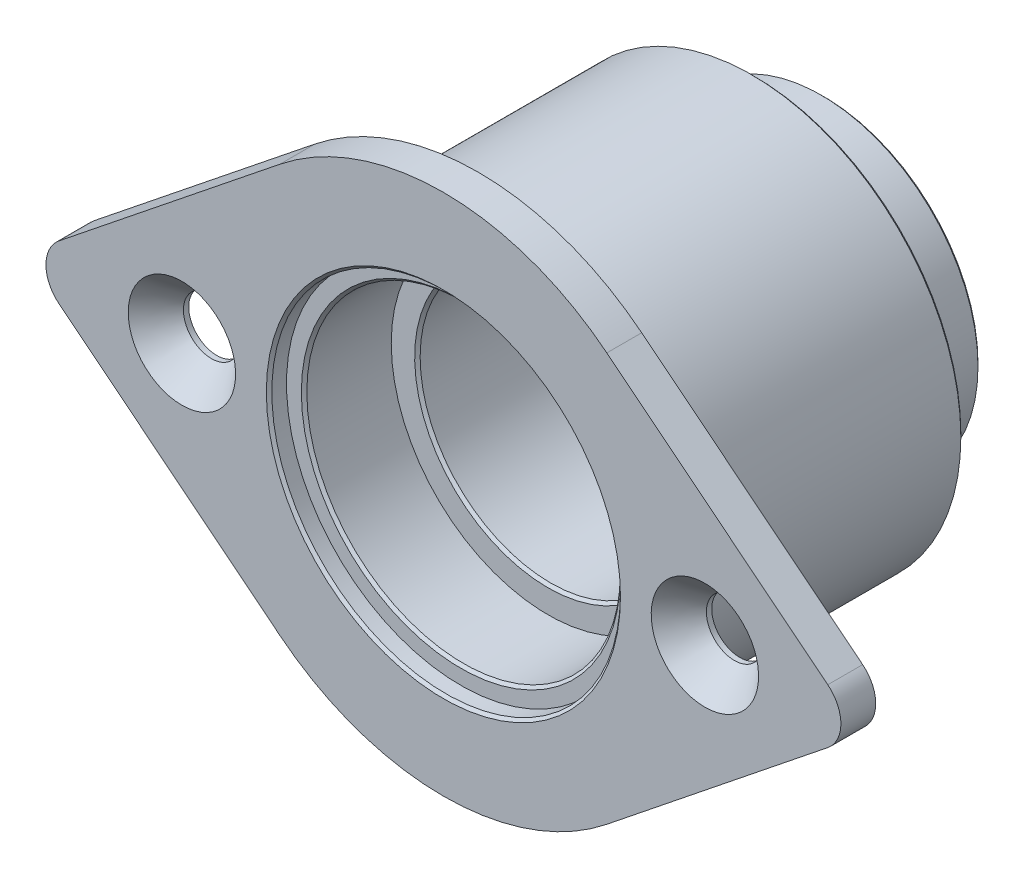
ISO-10303-21;
HEADER;
FILE_DESCRIPTION(('STEP AP214'),'2;1');
FILE_NAME('part.step','',(''),(''),'','','');
FILE_SCHEMA(('AUTOMOTIVE_DESIGN { 1 0 10303 214 1 1 1 1 }'));
ENDSEC;
DATA;
#1=APPLICATION_CONTEXT('core data for automotive mechanical design processes');
#2=APPLICATION_PROTOCOL_DEFINITION('international standard','automotive_design',2000,#1);
#3=PRODUCT_CONTEXT('',#1,'mechanical');
#4=PRODUCT('Part','Part','',(#3));
#5=PRODUCT_RELATED_PRODUCT_CATEGORY('part','',(#4));
#6=PRODUCT_DEFINITION_FORMATION('','',#4);
#7=PRODUCT_DEFINITION_CONTEXT('part definition',#1,'design');
#8=PRODUCT_DEFINITION('design','',#6,#7);
#9=PRODUCT_DEFINITION_SHAPE('','',#8);
#10=(LENGTH_UNIT() NAMED_UNIT(*) SI_UNIT(.MILLI.,.METRE.));
#11=(NAMED_UNIT(*) PLANE_ANGLE_UNIT() SI_UNIT($,.RADIAN.));
#12=(NAMED_UNIT(*) SI_UNIT($,.STERADIAN.) SOLID_ANGLE_UNIT());
#13=UNCERTAINTY_MEASURE_WITH_UNIT(LENGTH_MEASURE(1.E-05),#10,'distance_accuracy_value','');
#14=(GEOMETRIC_REPRESENTATION_CONTEXT(3) GLOBAL_UNCERTAINTY_ASSIGNED_CONTEXT((#13)) GLOBAL_UNIT_ASSIGNED_CONTEXT((#10,
#11,#12)) REPRESENTATION_CONTEXT('',''));
#15=CARTESIAN_POINT('',(0.,0.,0.));
#16=DIRECTION('',(0.,0.,1.));
#17=DIRECTION('',(1.,0.,0.));
#18=AXIS2_PLACEMENT_3D('',#15,#16,#17);
#19=CARTESIAN_POINT('',(0.,0.,-7.9375));
#20=DIRECTION('',(0.,0.,1.));
#21=DIRECTION('',(1.,0.,0.));
#22=AXIS2_PLACEMENT_3D('',#19,#20,#21);
#23=PLANE('',#22);
#24=CARTESIAN_POINT('',(0.,0.,-7.9375));
#25=DIRECTION('',(0.,0.,-1.));
#26=DIRECTION('',(-1.,0.,0.));
#27=AXIS2_PLACEMENT_3D('',#24,#25,#26);
#28=CIRCLE('',#27,14.2748);
#29=CARTESIAN_POINT('',(-14.2748,0.,-7.9375));
#30=VERTEX_POINT('',#29);
#31=EDGE_CURVE('E135',#30,#30,#28,.F.);
#32=ORIENTED_EDGE('',*,*,#31,.T.);
#33=EDGE_LOOP('',(#32));
#34=FACE_BOUND('',#33,.T.);
#35=CARTESIAN_POINT('',(0.,0.,-7.9375));
#36=DIRECTION('',(0.,0.,1.));
#37=DIRECTION('',(0.,-1.,0.));
#38=AXIS2_PLACEMENT_3D('',#35,#36,#37);
#39=CIRCLE('',#38,12.1435499999999);
#40=CARTESIAN_POINT('',(0.,-12.1435499999999,-7.9375));
#41=VERTEX_POINT('',#40);
#42=EDGE_CURVE('E19',#41,#41,#39,.F.);
#43=ORIENTED_EDGE('',*,*,#42,.T.);
#44=EDGE_LOOP('',(#43));
#45=FACE_BOUND('',#44,.T.);
#46=ADVANCED_FACE('F16',(#34,#45),#23,.T.);
#47=CARTESIAN_POINT('',(0.,0.,-7.9375));
#48=DIRECTION('',(0.,0.,1.));
#49=DIRECTION('',(0.,-1.,0.));
#50=AXIS2_PLACEMENT_3D('',#47,#48,#49);
#51=CONICAL_SURFACE('',#50,12.1435499999999,0.785398163397434);
#52=CARTESIAN_POINT('',(0.,0.,-8.18749999999995));
#53=DIRECTION('',(0.,0.,-1.));
#54=DIRECTION('',(-1.,0.,0.));
#55=AXIS2_PLACEMENT_3D('',#52,#53,#54);
#56=CIRCLE('',#55,11.89355);
#57=CARTESIAN_POINT('',(-11.89355,0.,-8.18749999999995));
#58=VERTEX_POINT('',#57);
#59=EDGE_CURVE('E133',#58,#58,#56,.T.);
#60=ORIENTED_EDGE('',*,*,#59,.T.);
#61=EDGE_LOOP('',(#60));
#62=FACE_BOUND('',#61,.T.);
#63=ORIENTED_EDGE('',*,*,#42,.F.);
#64=EDGE_LOOP('',(#63));
#65=FACE_BOUND('',#64,.T.);
#66=ADVANCED_FACE('F194',(#62,#65),#51,.F.);
#67=CARTESIAN_POINT('',(0.,0.,1.5875));
#68=DIRECTION('',(0.,0.,-1.));
#69=DIRECTION('',(-1.,0.,0.));
#70=AXIS2_PLACEMENT_3D('',#67,#68,#69);
#71=CYLINDRICAL_SURFACE('',#70,14.2748);
#72=CARTESIAN_POINT('',(0.,0.,-0.249999999999985));
#73=DIRECTION('',(0.,0.,1.));
#74=DIRECTION('',(1.,0.,0.));
#75=AXIS2_PLACEMENT_3D('',#72,#73,#74);
#76=CIRCLE('',#75,14.2748);
#77=CARTESIAN_POINT('',(14.2748,0.,-0.249999999999985));
#78=VERTEX_POINT('',#77);
#79=EDGE_CURVE('E130',#78,#78,#76,.T.);
#80=ORIENTED_EDGE('',*,*,#79,.T.);
#81=EDGE_LOOP('',(#80));
#82=FACE_BOUND('',#81,.T.);
#83=ORIENTED_EDGE('',*,*,#31,.F.);
#84=EDGE_LOOP('',(#83));
#85=FACE_BOUND('',#84,.T.);
#86=ADVANCED_FACE('F196',(#82,#85),#71,.F.);
#87=CARTESIAN_POINT('',(0.,0.,38.7877315203269));
#88=DIRECTION('',(0.,0.,-1.));
#89=DIRECTION('',(-1.,0.,0.));
#90=AXIS2_PLACEMENT_3D('',#87,#88,#89);
#91=CYLINDRICAL_SURFACE('',#90,11.89355);
#92=ORIENTED_EDGE('',*,*,#59,.F.);
#93=EDGE_LOOP('',(#92));
#94=FACE_BOUND('',#93,.T.);
#95=CARTESIAN_POINT('',(0.,0.,-32.8334999999999));
#96=DIRECTION('',(0.,0.,-1.));
#97=DIRECTION('',(-1.,0.,0.));
#98=AXIS2_PLACEMENT_3D('',#95,#96,#97);
#99=CIRCLE('',#98,11.89355);
#100=CARTESIAN_POINT('',(-11.89355,0.,-32.8334999999999));
#101=VERTEX_POINT('',#100);
#102=EDGE_CURVE('E126',#101,#101,#99,.T.);
#103=ORIENTED_EDGE('',*,*,#102,.T.);
#104=EDGE_LOOP('',(#103));
#105=FACE_BOUND('',#104,.T.);
#106=ADVANCED_FACE('F203',(#94,#105),#91,.F.);
#107=CARTESIAN_POINT('',(0.,0.,0.));
#108=DIRECTION('',(0.,0.,1.));
#109=DIRECTION('',(1.,0.,0.));
#110=AXIS2_PLACEMENT_3D('',#107,#108,#109);
#111=CONICAL_SURFACE('',#110,14.5248,0.785398163397459);
#112=ORIENTED_EDGE('',*,*,#79,.F.);
#113=EDGE_LOOP('',(#112));
#114=FACE_BOUND('',#113,.T.);
#115=CARTESIAN_POINT('',(0.,0.,0.));
#116=DIRECTION('',(0.,0.,1.));
#117=DIRECTION('',(1.,0.,0.));
#118=AXIS2_PLACEMENT_3D('',#115,#116,#117);
#119=CIRCLE('',#118,14.5248);
#120=CARTESIAN_POINT('',(14.5248,0.,0.));
#121=VERTEX_POINT('',#120);
#122=EDGE_CURVE('E129',#121,#121,#119,.F.);
#123=ORIENTED_EDGE('',*,*,#122,.F.);
#124=EDGE_LOOP('',(#123));
#125=FACE_BOUND('',#124,.T.);
#126=ADVANCED_FACE('F300',(#114,#125),#111,.F.);
#127=CARTESIAN_POINT('',(0.,0.,-33.0835));
#128=DIRECTION('',(0.,0.,-1.));
#129=DIRECTION('',(0.,1.,0.));
#130=AXIS2_PLACEMENT_3D('',#127,#128,#129);
#131=CONICAL_SURFACE('',#130,12.1435500000001,0.785398163397448);
#132=ORIENTED_EDGE('',*,*,#102,.F.);
#133=EDGE_LOOP('',(#132));
#134=FACE_BOUND('',#133,.T.);
#135=CARTESIAN_POINT('',(0.,0.,-33.0835));
#136=DIRECTION('',(0.,0.,-1.));
#137=DIRECTION('',(0.,1.,0.));
#138=AXIS2_PLACEMENT_3D('',#135,#136,#137);
#139=CIRCLE('',#138,12.1435500000001);
#140=CARTESIAN_POINT('',(0.,12.1435500000001,-33.0835));
#141=VERTEX_POINT('',#140);
#142=EDGE_CURVE('E183',#141,#141,#139,.F.);
#143=ORIENTED_EDGE('',*,*,#142,.F.);
#144=EDGE_LOOP('',(#143));
#145=FACE_BOUND('',#144,.T.);
#146=ADVANCED_FACE('F296',(#134,#145),#131,.F.);
#147=CARTESIAN_POINT('',(0.,0.,0.));
#148=DIRECTION('',(0.,0.,1.));
#149=DIRECTION('',(1.,0.,0.));
#150=AXIS2_PLACEMENT_3D('',#147,#148,#149);
#151=PLANE('',#150);
#152=CARTESIAN_POINT('',(0.,0.,0.));
#153=DIRECTION('',(0.,0.,1.));
#154=DIRECTION('',(1.,0.,0.));
#155=AXIS2_PLACEMENT_3D('',#152,#153,#154);
#156=CIRCLE('',#155,15.875);
#157=CARTESIAN_POINT('',(15.875,0.,0.));
#158=VERTEX_POINT('',#157);
#159=EDGE_CURVE('E180',#158,#158,#156,.T.);
#160=ORIENTED_EDGE('',*,*,#159,.T.);
#161=EDGE_LOOP('',(#160));
#162=FACE_BOUND('',#161,.T.);
#163=ORIENTED_EDGE('',*,*,#122,.T.);
#164=EDGE_LOOP('',(#163));
#165=FACE_BOUND('',#164,.T.);
#166=ADVANCED_FACE('F292',(#162,#165),#151,.T.);
#167=CARTESIAN_POINT('',(0.,0.,-33.0835));
#168=DIRECTION('',(0.,0.,-1.));
#169=DIRECTION('',(-1.,0.,0.));
#170=AXIS2_PLACEMENT_3D('',#167,#168,#169);
#171=PLANE('',#170);
#172=ORIENTED_EDGE('',*,*,#142,.T.);
#173=EDGE_LOOP('',(#172));
#174=FACE_BOUND('',#173,.T.);
#175=CARTESIAN_POINT('',(0.,0.,-33.0835));
#176=DIRECTION('',(0.,0.,1.));
#177=DIRECTION('',(1.,0.,0.));
#178=AXIS2_PLACEMENT_3D('',#175,#176,#177);
#179=CIRCLE('',#178,14.0121);
#180=CARTESIAN_POINT('',(14.0121,0.,-33.0835));
#181=VERTEX_POINT('',#180);
#182=EDGE_CURVE('E125',#181,#181,#179,.T.);
#183=ORIENTED_EDGE('',*,*,#182,.F.);
#184=EDGE_LOOP('',(#183));
#185=FACE_BOUND('',#184,.T.);
#186=ADVANCED_FACE('F288',(#174,#185),#171,.T.);
#187=CARTESIAN_POINT('',(0.,0.,0.));
#188=DIRECTION('',(0.,0.,1.));
#189=DIRECTION('',(1.,0.,0.));
#190=AXIS2_PLACEMENT_3D('',#187,#188,#189);
#191=CYLINDRICAL_SURFACE('',#190,15.875);
#192=ORIENTED_EDGE('',*,*,#159,.F.);
#193=EDGE_LOOP('',(#192));
#194=FACE_BOUND('',#193,.T.);
#195=CARTESIAN_POINT('',(0.,0.,1.3375));
#196=DIRECTION('',(0.,0.,1.));
#197=DIRECTION('',(1.,0.,0.));
#198=AXIS2_PLACEMENT_3D('',#195,#196,#197);
#199=CIRCLE('',#198,15.875);
#200=CARTESIAN_POINT('',(15.875,0.,1.3375));
#201=VERTEX_POINT('',#200);
#202=EDGE_CURVE('E122',#201,#201,#199,.T.);
#203=ORIENTED_EDGE('',*,*,#202,.T.);
#204=EDGE_LOOP('',(#203));
#205=FACE_BOUND('',#204,.T.);
#206=ADVANCED_FACE('F284',(#194,#205),#191,.F.);
#207=CARTESIAN_POINT('',(0.,0.,-32.8335));
#208=DIRECTION('',(0.,0.,1.));
#209=DIRECTION('',(1.,0.,0.));
#210=AXIS2_PLACEMENT_3D('',#207,#208,#209);
#211=CONICAL_SURFACE('',#210,14.2621,0.785398163397424);
#212=CARTESIAN_POINT('',(0.,0.,-32.8335));
#213=DIRECTION('',(0.,0.,-1.));
#214=DIRECTION('',(-1.,0.,0.));
#215=AXIS2_PLACEMENT_3D('',#212,#213,#214);
#216=CIRCLE('',#215,14.2621);
#217=CARTESIAN_POINT('',(-14.2621,0.,-32.8335));
#218=VERTEX_POINT('',#217);
#219=EDGE_CURVE('E118',#218,#218,#216,.F.);
#220=ORIENTED_EDGE('',*,*,#219,.F.);
#221=EDGE_LOOP('',(#220));
#222=FACE_BOUND('',#221,.T.);
#223=ORIENTED_EDGE('',*,*,#182,.T.);
#224=EDGE_LOOP('',(#223));
#225=FACE_BOUND('',#224,.T.);
#226=ADVANCED_FACE('F280',(#222,#225),#211,.T.);
#227=CARTESIAN_POINT('',(0.,0.,1.5875));
#228=DIRECTION('',(0.,0.,1.));
#229=DIRECTION('',(1.,0.,0.));
#230=AXIS2_PLACEMENT_3D('',#227,#228,#229);
#231=CONICAL_SURFACE('',#230,16.125,0.785398163397476);
#232=ORIENTED_EDGE('',*,*,#202,.F.);
#233=EDGE_LOOP('',(#232));
#234=FACE_BOUND('',#233,.T.);
#235=CARTESIAN_POINT('',(0.,0.,1.5875));
#236=DIRECTION('',(0.,0.,1.));
#237=DIRECTION('',(1.,0.,0.));
#238=AXIS2_PLACEMENT_3D('',#235,#236,#237);
#239=CIRCLE('',#238,16.125);
#240=CARTESIAN_POINT('',(16.125,0.,1.5875));
#241=VERTEX_POINT('',#240);
#242=EDGE_CURVE('E121',#241,#241,#239,.F.);
#243=ORIENTED_EDGE('',*,*,#242,.F.);
#244=EDGE_LOOP('',(#243));
#245=FACE_BOUND('',#244,.T.);
#246=ADVANCED_FACE('F276',(#234,#245),#231,.F.);
#247=CARTESIAN_POINT('',(0.,0.,27.1480367264149));
#248=DIRECTION('',(0.,0.,-1.));
#249=DIRECTION('',(-1.,0.,0.));
#250=AXIS2_PLACEMENT_3D('',#247,#248,#249);
#251=CYLINDRICAL_SURFACE('',#250,14.2621);
#252=ORIENTED_EDGE('',*,*,#219,.T.);
#253=EDGE_LOOP('',(#252));
#254=FACE_BOUND('',#253,.T.);
#255=CARTESIAN_POINT('',(0.,0.,-26.7335));
#256=DIRECTION('',(0.,0.,-1.));
#257=DIRECTION('',(-1.,0.,0.));
#258=AXIS2_PLACEMENT_3D('',#255,#256,#257);
#259=CIRCLE('',#258,14.2621);
#260=CARTESIAN_POINT('',(-14.2621,0.,-26.7335));
#261=VERTEX_POINT('',#260);
#262=EDGE_CURVE('E117',#261,#261,#259,.F.);
#263=ORIENTED_EDGE('',*,*,#262,.F.);
#264=EDGE_LOOP('',(#263));
#265=FACE_BOUND('',#264,.T.);
#266=ADVANCED_FACE('F272',(#254,#265),#251,.T.);
#267=CARTESIAN_POINT('',(-23.8125,0.,1.58749999997099));
#268=DIRECTION('',(0.,0.,1.));
#269=DIRECTION('',(0.,-1.,0.));
#270=AXIS2_PLACEMENT_3D('',#267,#268,#269);
#271=CONICAL_SURFACE('',#270,4.88949999997067,0.71558499333661);
#272=CARTESIAN_POINT('',(-23.8125,0.,-1.10068089399406));
#273=DIRECTION('',(0.,0.,1.));
#274=DIRECTION('',(1.,0.,0.));
#275=AXIS2_PLACEMENT_3D('',#272,#273,#274);
#276=CIRCLE('',#275,2.5527);
#277=CARTESIAN_POINT('',(-21.2598,0.,-1.10068089399406));
#278=VERTEX_POINT('',#277);
#279=EDGE_CURVE('E114',#278,#278,#276,.F.);
#280=ORIENTED_EDGE('',*,*,#279,.T.);
#281=EDGE_LOOP('',(#280));
#282=FACE_BOUND('',#281,.T.);
#283=CARTESIAN_POINT('',(-23.8125,0.,1.58749999997099));
#284=DIRECTION('',(0.,0.,1.));
#285=DIRECTION('',(0.,-1.,0.));
#286=AXIS2_PLACEMENT_3D('',#283,#284,#285);
#287=CIRCLE('',#286,4.88949999997067);
#288=CARTESIAN_POINT('',(-23.8125,-4.88949999997067,1.58749999997099));
#289=VERTEX_POINT('',#288);
#290=EDGE_CURVE('E173',#289,#289,#287,.F.);
#291=ORIENTED_EDGE('',*,*,#290,.F.);
#292=EDGE_LOOP('',(#291));
#293=FACE_BOUND('',#292,.T.);
#294=ADVANCED_FACE('F268',(#282,#293),#271,.F.);
#295=CARTESIAN_POINT('',(23.8125,0.,1.58749999997099));
#296=DIRECTION('',(0.,0.,1.));
#297=DIRECTION('',(0.,-1.,0.));
#298=AXIS2_PLACEMENT_3D('',#295,#296,#297);
#299=CONICAL_SURFACE('',#298,4.88949999995293,0.71558499333661);
#300=CARTESIAN_POINT('',(23.8125,0.,-1.10068089399406));
#301=DIRECTION('',(0.,0.,1.));
#302=DIRECTION('',(1.,0.,0.));
#303=AXIS2_PLACEMENT_3D('',#300,#301,#302);
#304=CIRCLE('',#303,2.5527);
#305=CARTESIAN_POINT('',(26.3652,0.,-1.10068089399406));
#306=VERTEX_POINT('',#305);
#307=EDGE_CURVE('E92',#306,#306,#304,.F.);
#308=ORIENTED_EDGE('',*,*,#307,.T.);
#309=EDGE_LOOP('',(#308));
#310=FACE_BOUND('',#309,.T.);
#311=CARTESIAN_POINT('',(23.8125,0.,1.58749999997099));
#312=DIRECTION('',(0.,0.,1.));
#313=DIRECTION('',(0.,-1.,0.));
#314=AXIS2_PLACEMENT_3D('',#311,#312,#313);
#315=CIRCLE('',#314,4.88949999995293);
#316=CARTESIAN_POINT('',(23.8125,-4.88949999995292,1.58749999997099));
#317=VERTEX_POINT('',#316);
#318=EDGE_CURVE('E170',#317,#317,#315,.F.);
#319=ORIENTED_EDGE('',*,*,#318,.F.);
#320=EDGE_LOOP('',(#319));
#321=FACE_BOUND('',#320,.T.);
#322=ADVANCED_FACE('F265',(#310,#321),#299,.F.);
#323=CARTESIAN_POINT('',(0.,0.,1.5875));
#324=DIRECTION('',(0.,0.,1.));
#325=DIRECTION('',(1.,0.,0.));
#326=AXIS2_PLACEMENT_3D('',#323,#324,#325);
#327=PLANE('',#326);
#328=DIRECTION('',(-0.7806247497998,0.625,0.));
#329=VECTOR('',#328,1.);
#330=CARTESIAN_POINT('',(-14.8828125,-18.5886268546077,1.5875));
#331=LINE('',#330,#329);
#332=CARTESIAN_POINT('',(-35.004375,-2.47848358061436,1.5875));
#333=VERTEX_POINT('',#332);
#334=CARTESIAN_POINT('',(-14.8828125,-18.5886268546077,1.5875));
#335=VERTEX_POINT('',#334);
#336=EDGE_CURVE('E110',#333,#335,#331,.F.);
#337=ORIENTED_EDGE('',*,*,#336,.T.);
#338=CARTESIAN_POINT('',(0.,0.,1.5875));
#339=DIRECTION('',(0.,0.,-1.));
#340=DIRECTION('',(-1.,0.,0.));
#341=AXIS2_PLACEMENT_3D('',#338,#339,#340);
#342=CIRCLE('',#341,23.8125);
#343=CARTESIAN_POINT('',(14.8828125,-18.5886268546077,1.5875));
#344=VERTEX_POINT('',#343);
#345=EDGE_CURVE('E162',#344,#335,#342,.T.);
#346=ORIENTED_EDGE('',*,*,#345,.F.);
#347=DIRECTION('',(0.7806247497998,0.625,0.));
#348=VECTOR('',#347,1.);
#349=CARTESIAN_POINT('',(14.8828125,-18.5886268546077,1.5875));
#350=LINE('',#349,#348);
#351=CARTESIAN_POINT('',(35.004375,-2.47848358061437,1.5875));
#352=VERTEX_POINT('',#351);
#353=EDGE_CURVE('E526',#352,#344,#350,.F.);
#354=ORIENTED_EDGE('',*,*,#353,.F.);
#355=CARTESIAN_POINT('',(33.02,0.,1.5875));
#356=DIRECTION('',(0.,0.,-1.));
#357=DIRECTION('',(-1.,0.,0.));
#358=AXIS2_PLACEMENT_3D('',#355,#356,#357);
#359=CIRCLE('',#358,3.175);
#360=CARTESIAN_POINT('',(35.004375,2.47848358061436,1.5875));
#361=VERTEX_POINT('',#360);
#362=EDGE_CURVE('E157',#361,#352,#359,.T.);
#363=ORIENTED_EDGE('',*,*,#362,.F.);
#364=DIRECTION('',(-0.7806247497998,0.625,0.));
#365=VECTOR('',#364,1.);
#366=CARTESIAN_POINT('',(14.8828125,18.5886268546077,1.5875));
#367=LINE('',#366,#365);
#368=CARTESIAN_POINT('',(14.8828125,18.5886268546077,1.5875));
#369=VERTEX_POINT('',#368);
#370=EDGE_CURVE('E88',#369,#361,#367,.F.);
#371=ORIENTED_EDGE('',*,*,#370,.F.);
#372=CARTESIAN_POINT('',(0.,0.,1.5875));
#373=DIRECTION('',(0.,0.,-1.));
#374=DIRECTION('',(-1.,0.,0.));
#375=AXIS2_PLACEMENT_3D('',#372,#373,#374);
#376=CIRCLE('',#375,23.8125);
#377=CARTESIAN_POINT('',(-14.8828125,18.5886268546077,1.5875));
#378=VERTEX_POINT('',#377);
#379=EDGE_CURVE('E80',#378,#369,#376,.T.);
#380=ORIENTED_EDGE('',*,*,#379,.F.);
#381=DIRECTION('',(0.7806247497998,0.625,0.));
#382=VECTOR('',#381,1.);
#383=CARTESIAN_POINT('',(-14.8828125,18.5886268546077,1.5875));
#384=LINE('',#383,#382);
#385=CARTESIAN_POINT('',(-35.004375,2.47848358061436,1.5875));
#386=VERTEX_POINT('',#385);
#387=EDGE_CURVE('E85',#378,#386,#384,.F.);
#388=ORIENTED_EDGE('',*,*,#387,.T.);
#389=CARTESIAN_POINT('',(-33.02,0.,1.5875));
#390=DIRECTION('',(0.,0.,-1.));
#391=DIRECTION('',(-1.,0.,0.));
#392=AXIS2_PLACEMENT_3D('',#389,#390,#391);
#393=CIRCLE('',#392,3.175);
#394=EDGE_CURVE('E106',#333,#386,#393,.T.);
#395=ORIENTED_EDGE('',*,*,#394,.F.);
#396=EDGE_LOOP('',(#337,#346,#354,#363,#371,#380,#388,#395));
#397=FACE_BOUND('',#396,.T.);
#398=ORIENTED_EDGE('',*,*,#318,.T.);
#399=EDGE_LOOP('',(#398));
#400=FACE_BOUND('',#399,.T.);
#401=ORIENTED_EDGE('',*,*,#290,.T.);
#402=EDGE_LOOP('',(#401));
#403=FACE_BOUND('',#402,.T.);
#404=ORIENTED_EDGE('',*,*,#242,.T.);
#405=EDGE_LOOP('',(#404));
#406=FACE_BOUND('',#405,.T.);
#407=ADVANCED_FACE('F82',(#397,#400,#403,#406),#327,.T.);
#408=CARTESIAN_POINT('',(0.,0.,-26.7335));
#409=DIRECTION('',(0.,0.,-1.));
#410=DIRECTION('',(-1.,0.,0.));
#411=AXIS2_PLACEMENT_3D('',#408,#409,#410);
#412=PLANE('',#411);
#413=ORIENTED_EDGE('',*,*,#262,.T.);
#414=EDGE_LOOP('',(#413));
#415=FACE_BOUND('',#414,.T.);
#416=CARTESIAN_POINT('',(0.,0.,-26.7335));
#417=DIRECTION('',(0.,0.,1.));
#418=DIRECTION('',(1.,0.,0.));
#419=AXIS2_PLACEMENT_3D('',#416,#417,#418);
#420=CIRCLE('',#419,18.8);
#421=CARTESIAN_POINT('',(18.8,0.,-26.7335));
#422=VERTEX_POINT('',#421);
#423=EDGE_CURVE('E153',#422,#422,#420,.T.);
#424=ORIENTED_EDGE('',*,*,#423,.F.);
#425=EDGE_LOOP('',(#424));
#426=FACE_BOUND('',#425,.T.);
#427=ADVANCED_FACE('F258',(#415,#426),#412,.T.);
#428=CARTESIAN_POINT('',(-23.8125,0.,1.5875));
#429=DIRECTION('',(0.,0.,1.));
#430=DIRECTION('',(1.,0.,0.));
#431=AXIS2_PLACEMENT_3D('',#428,#429,#430);
#432=CYLINDRICAL_SURFACE('',#431,2.5527);
#433=CARTESIAN_POINT('',(-23.8125,0.,-1.5875));
#434=DIRECTION('',(0.,0.,1.));
#435=DIRECTION('',(1.,0.,0.));
#436=AXIS2_PLACEMENT_3D('',#433,#434,#435);
#437=CIRCLE('',#436,2.5527);
#438=CARTESIAN_POINT('',(-21.2598,0.,-1.5875));
#439=VERTEX_POINT('',#438);
#440=EDGE_CURVE('E150',#439,#439,#437,.F.);
#441=ORIENTED_EDGE('',*,*,#440,.T.);
#442=EDGE_LOOP('',(#441));
#443=FACE_BOUND('',#442,.T.);
#444=ORIENTED_EDGE('',*,*,#279,.F.);
#445=EDGE_LOOP('',(#444));
#446=FACE_BOUND('',#445,.T.);
#447=ADVANCED_FACE('F254',(#443,#446),#432,.F.);
#448=CARTESIAN_POINT('',(23.8125,0.,1.5875));
#449=DIRECTION('',(0.,0.,1.));
#450=DIRECTION('',(1.,0.,0.));
#451=AXIS2_PLACEMENT_3D('',#448,#449,#450);
#452=CYLINDRICAL_SURFACE('',#451,2.5527);
#453=CARTESIAN_POINT('',(23.8125,0.,-1.5875));
#454=DIRECTION('',(0.,0.,1.));
#455=DIRECTION('',(1.,0.,0.));
#456=AXIS2_PLACEMENT_3D('',#453,#454,#455);
#457=CIRCLE('',#456,2.5527);
#458=CARTESIAN_POINT('',(26.3652,0.,-1.5875));
#459=VERTEX_POINT('',#458);
#460=EDGE_CURVE('E147',#459,#459,#457,.F.);
#461=ORIENTED_EDGE('',*,*,#460,.T.);
#462=EDGE_LOOP('',(#461));
#463=FACE_BOUND('',#462,.T.);
#464=ORIENTED_EDGE('',*,*,#307,.F.);
#465=EDGE_LOOP('',(#464));
#466=FACE_BOUND('',#465,.T.);
#467=ADVANCED_FACE('F251',(#463,#466),#452,.F.);
#468=CARTESIAN_POINT('',(0.,0.,1.5875));
#469=DIRECTION('',(0.,0.,-1.));
#470=DIRECTION('',(-1.,0.,0.));
#471=AXIS2_PLACEMENT_3D('',#468,#469,#470);
#472=CYLINDRICAL_SURFACE('',#471,23.8125);
#473=ORIENTED_EDGE('',*,*,#379,.T.);
#474=DIRECTION('',(0.,0.,1.));
#475=VECTOR('',#474,1.);
#476=CARTESIAN_POINT('',(14.8828125,18.5886268546077,1.5875));
#477=LINE('',#476,#475);
#478=CARTESIAN_POINT('',(14.8828125,18.5886268546077,-1.5875));
#479=VERTEX_POINT('',#478);
#480=EDGE_CURVE('E156',#479,#369,#477,.T.);
#481=ORIENTED_EDGE('',*,*,#480,.F.);
#482=CARTESIAN_POINT('',(0.,0.,-1.5875));
#483=DIRECTION('',(0.,0.,-1.));
#484=DIRECTION('',(-1.,0.,0.));
#485=AXIS2_PLACEMENT_3D('',#482,#483,#484);
#486=CIRCLE('',#485,23.8125);
#487=CARTESIAN_POINT('',(-14.8828125,18.5886268546077,-1.5875));
#488=VERTEX_POINT('',#487);
#489=EDGE_CURVE('E97',#479,#488,#486,.F.);
#490=ORIENTED_EDGE('',*,*,#489,.T.);
#491=DIRECTION('',(0.,0.,1.));
#492=VECTOR('',#491,1.);
#493=CARTESIAN_POINT('',(-14.8828125,18.5886268546077,1.5875));
#494=LINE('',#493,#492);
#495=EDGE_CURVE('E91',#488,#378,#494,.T.);
#496=ORIENTED_EDGE('',*,*,#495,.T.);
#497=EDGE_LOOP('',(#473,#481,#490,#496));
#498=FACE_BOUND('',#497,.T.);
#499=ADVANCED_FACE('F95',(#498),#472,.T.);
#500=CARTESIAN_POINT('',(-14.8828125,18.5886268546077,1.5875));
#501=DIRECTION('',(0.625,-0.7806247497998,0.));
#502=DIRECTION('',(0.7806247497998,0.625,0.));
#503=AXIS2_PLACEMENT_3D('',#500,#501,#502);
#504=PLANE('',#503);
#505=DIRECTION('',(0.,0.,-1.));
#506=VECTOR('',#505,1.);
#507=CARTESIAN_POINT('',(-35.004375,2.47848358061435,1.5875));
#508=LINE('',#507,#506);
#509=CARTESIAN_POINT('',(-35.004375,2.47848358061436,-1.5875));
#510=VERTEX_POINT('',#509);
#511=EDGE_CURVE('E104',#386,#510,#508,.T.);
#512=ORIENTED_EDGE('',*,*,#511,.F.);
#513=ORIENTED_EDGE('',*,*,#387,.F.);
#514=ORIENTED_EDGE('',*,*,#495,.F.);
#515=DIRECTION('',(-0.7806247497998,-0.625,0.));
#516=VECTOR('',#515,1.);
#517=CARTESIAN_POINT('',(-14.8828125,18.5886268546077,-1.5875));
#518=LINE('',#517,#516);
#519=EDGE_CURVE('E145',#488,#510,#518,.T.);
#520=ORIENTED_EDGE('',*,*,#519,.T.);
#521=EDGE_LOOP('',(#512,#513,#514,#520));
#522=FACE_BOUND('',#521,.T.);
#523=ADVANCED_FACE('F102',(#522),#504,.F.);
#524=CARTESIAN_POINT('',(-33.02,0.,1.5875));
#525=DIRECTION('',(0.,0.,-1.));
#526=DIRECTION('',(-1.,0.,0.));
#527=AXIS2_PLACEMENT_3D('',#524,#525,#526);
#528=CYLINDRICAL_SURFACE('',#527,3.175);
#529=CARTESIAN_POINT('',(-33.02,0.,-1.5875));
#530=DIRECTION('',(0.,0.,-1.));
#531=DIRECTION('',(-1.,0.,0.));
#532=AXIS2_PLACEMENT_3D('',#529,#530,#531);
#533=CIRCLE('',#532,3.175);
#534=CARTESIAN_POINT('',(-35.004375,-2.47848358061437,-1.5875));
#535=VERTEX_POINT('',#534);
#536=EDGE_CURVE('E143',#510,#535,#533,.F.);
#537=ORIENTED_EDGE('',*,*,#536,.T.);
#538=DIRECTION('',(0.,0.,1.));
#539=VECTOR('',#538,1.);
#540=CARTESIAN_POINT('',(-35.004375,-2.47848358061437,1.5875));
#541=LINE('',#540,#539);
#542=EDGE_CURVE('E166',#535,#333,#541,.T.);
#543=ORIENTED_EDGE('',*,*,#542,.T.);
#544=ORIENTED_EDGE('',*,*,#394,.T.);
#545=ORIENTED_EDGE('',*,*,#511,.T.);
#546=EDGE_LOOP('',(#537,#543,#544,#545));
#547=FACE_BOUND('',#546,.T.);
#548=ADVANCED_FACE('F242',(#547),#528,.T.);
#549=CARTESIAN_POINT('',(-14.8828125,-18.5886268546077,1.5875));
#550=DIRECTION('',(0.625,0.7806247497998,0.));
#551=DIRECTION('',(-0.7806247497998,0.625,0.));
#552=AXIS2_PLACEMENT_3D('',#549,#550,#551);
#553=PLANE('',#552);
#554=ORIENTED_EDGE('',*,*,#542,.F.);
#555=DIRECTION('',(0.7806247497998,-0.625,0.));
#556=VECTOR('',#555,1.);
#557=CARTESIAN_POINT('',(-35.004375,-2.47848358061437,-1.5875));
#558=LINE('',#557,#556);
#559=CARTESIAN_POINT('',(-14.8828125,-18.5886268546077,-1.5875));
#560=VERTEX_POINT('',#559);
#561=EDGE_CURVE('E142',#535,#560,#558,.T.);
#562=ORIENTED_EDGE('',*,*,#561,.T.);
#563=DIRECTION('',(0.,0.,-1.));
#564=VECTOR('',#563,1.);
#565=CARTESIAN_POINT('',(-14.8828125,-18.5886268546077,1.5875));
#566=LINE('',#565,#564);
#567=EDGE_CURVE('E165',#335,#560,#566,.T.);
#568=ORIENTED_EDGE('',*,*,#567,.F.);
#569=ORIENTED_EDGE('',*,*,#336,.F.);
#570=EDGE_LOOP('',(#554,#562,#568,#569));
#571=FACE_BOUND('',#570,.T.);
#572=ADVANCED_FACE('F238',(#571),#553,.F.);
#573=CARTESIAN_POINT('',(0.,0.,1.5875));
#574=DIRECTION('',(0.,0.,-1.));
#575=DIRECTION('',(-1.,0.,0.));
#576=AXIS2_PLACEMENT_3D('',#573,#574,#575);
#577=CYLINDRICAL_SURFACE('',#576,23.8125);
#578=ORIENTED_EDGE('',*,*,#345,.T.);
#579=ORIENTED_EDGE('',*,*,#567,.T.);
#580=CARTESIAN_POINT('',(0.,0.,-1.5875));
#581=DIRECTION('',(0.,0.,-1.));
#582=DIRECTION('',(-1.,0.,0.));
#583=AXIS2_PLACEMENT_3D('',#580,#581,#582);
#584=CIRCLE('',#583,23.8125);
#585=CARTESIAN_POINT('',(14.8828125,-18.5886268546077,-1.5875));
#586=VERTEX_POINT('',#585);
#587=EDGE_CURVE('E140',#560,#586,#584,.F.);
#588=ORIENTED_EDGE('',*,*,#587,.T.);
#589=DIRECTION('',(0.,0.,1.));
#590=VECTOR('',#589,1.);
#591=CARTESIAN_POINT('',(14.8828125,-18.5886268546077,1.5875));
#592=LINE('',#591,#590);
#593=EDGE_CURVE('E161',#344,#586,#592,.F.);
#594=ORIENTED_EDGE('',*,*,#593,.F.);
#595=EDGE_LOOP('',(#578,#579,#588,#594));
#596=FACE_BOUND('',#595,.T.);
#597=ADVANCED_FACE('F234',(#596),#577,.T.);
#598=CARTESIAN_POINT('',(14.8828125,-18.5886268546077,1.5875));
#599=DIRECTION('',(0.625,-0.7806247497998,0.));
#600=DIRECTION('',(0.7806247497998,0.625,0.));
#601=AXIS2_PLACEMENT_3D('',#598,#599,#600);
#602=PLANE('',#601);
#603=ORIENTED_EDGE('',*,*,#353,.T.);
#604=ORIENTED_EDGE('',*,*,#593,.T.);
#605=DIRECTION('',(0.7806247497998,0.625,0.));
#606=VECTOR('',#605,1.);
#607=CARTESIAN_POINT('',(14.8828125,-18.5886268546077,-1.5875));
#608=LINE('',#607,#606);
#609=CARTESIAN_POINT('',(35.004375,-2.47848358061437,-1.5875));
#610=VERTEX_POINT('',#609);
#611=EDGE_CURVE('E139',#586,#610,#608,.T.);
#612=ORIENTED_EDGE('',*,*,#611,.T.);
#613=DIRECTION('',(0.,0.,-1.));
#614=VECTOR('',#613,1.);
#615=CARTESIAN_POINT('',(35.004375,-2.47848358061437,1.5875));
#616=LINE('',#615,#614);
#617=EDGE_CURVE('E160',#352,#610,#616,.T.);
#618=ORIENTED_EDGE('',*,*,#617,.F.);
#619=EDGE_LOOP('',(#603,#604,#612,#618));
#620=FACE_BOUND('',#619,.T.);
#621=ADVANCED_FACE('F231',(#620),#602,.T.);
#622=CARTESIAN_POINT('',(33.02,0.,1.5875));
#623=DIRECTION('',(0.,0.,-1.));
#624=DIRECTION('',(-1.,0.,0.));
#625=AXIS2_PLACEMENT_3D('',#622,#623,#624);
#626=CYLINDRICAL_SURFACE('',#625,3.175);
#627=CARTESIAN_POINT('',(33.02,0.,-1.5875));
#628=DIRECTION('',(0.,0.,-1.));
#629=DIRECTION('',(-1.,0.,0.));
#630=AXIS2_PLACEMENT_3D('',#627,#628,#629);
#631=CIRCLE('',#630,3.175);
#632=CARTESIAN_POINT('',(35.004375,2.47848358061436,-1.5875));
#633=VERTEX_POINT('',#632);
#634=EDGE_CURVE('E34',#610,#633,#631,.F.);
#635=ORIENTED_EDGE('',*,*,#634,.T.);
#636=DIRECTION('',(0.,0.,1.));
#637=VECTOR('',#636,1.);
#638=CARTESIAN_POINT('',(35.004375,2.47848358061436,1.5875));
#639=LINE('',#638,#637);
#640=EDGE_CURVE('E520',#361,#633,#639,.F.);
#641=ORIENTED_EDGE('',*,*,#640,.F.);
#642=ORIENTED_EDGE('',*,*,#362,.T.);
#643=ORIENTED_EDGE('',*,*,#617,.T.);
#644=EDGE_LOOP('',(#635,#641,#642,#643));
#645=FACE_BOUND('',#644,.T.);
#646=ADVANCED_FACE('F227',(#645),#626,.T.);
#647=CARTESIAN_POINT('',(14.8828125,18.5886268546077,1.5875));
#648=DIRECTION('',(0.625,0.7806247497998,0.));
#649=DIRECTION('',(-0.7806247497998,0.625,0.));
#650=AXIS2_PLACEMENT_3D('',#647,#648,#649);
#651=PLANE('',#650);
#652=DIRECTION('',(-0.7806247497998,0.625,0.));
#653=VECTOR('',#652,1.);
#654=CARTESIAN_POINT('',(35.004375,2.47848358061437,-1.5875));
#655=LINE('',#654,#653);
#656=EDGE_CURVE('E138',#633,#479,#655,.T.);
#657=ORIENTED_EDGE('',*,*,#656,.T.);
#658=ORIENTED_EDGE('',*,*,#480,.T.);
#659=ORIENTED_EDGE('',*,*,#370,.T.);
#660=ORIENTED_EDGE('',*,*,#640,.T.);
#661=EDGE_LOOP('',(#657,#658,#659,#660));
#662=FACE_BOUND('',#661,.T.);
#663=ADVANCED_FACE('F223',(#662),#651,.T.);
#664=CARTESIAN_POINT('',(0.,0.,-26.4835));
#665=DIRECTION('',(0.,0.,1.));
#666=DIRECTION('',(1.,0.,0.));
#667=AXIS2_PLACEMENT_3D('',#664,#665,#666);
#668=CONICAL_SURFACE('',#667,19.05,0.785398163397434);
#669=ORIENTED_EDGE('',*,*,#423,.T.);
#670=EDGE_LOOP('',(#669));
#671=FACE_BOUND('',#670,.T.);
#672=CARTESIAN_POINT('',(0.,0.,-26.4835));
#673=DIRECTION('',(0.,0.,1.));
#674=DIRECTION('',(1.,0.,0.));
#675=AXIS2_PLACEMENT_3D('',#672,#673,#674);
#676=CIRCLE('',#675,19.05);
#677=CARTESIAN_POINT('',(19.05,0.,-26.4835));
#678=VERTEX_POINT('',#677);
#679=EDGE_CURVE('E25',#678,#678,#676,.T.);
#680=ORIENTED_EDGE('',*,*,#679,.F.);
#681=EDGE_LOOP('',(#680));
#682=FACE_BOUND('',#681,.T.);
#683=ADVANCED_FACE('F215',(#671,#682),#668,.T.);
#684=CARTESIAN_POINT('',(0.,0.,-1.5875));
#685=DIRECTION('',(0.,0.,1.));
#686=DIRECTION('',(1.,0.,0.));
#687=AXIS2_PLACEMENT_3D('',#684,#685,#686);
#688=PLANE('',#687);
#689=CARTESIAN_POINT('',(0.,0.,-1.5875));
#690=DIRECTION('',(0.,0.,1.));
#691=DIRECTION('',(1.,0.,0.));
#692=AXIS2_PLACEMENT_3D('',#689,#690,#691);
#693=CIRCLE('',#692,19.05);
#694=CARTESIAN_POINT('',(19.05,0.,-1.5875));
#695=VERTEX_POINT('',#694);
#696=EDGE_CURVE('E11',#695,#695,#693,.F.);
#697=ORIENTED_EDGE('',*,*,#696,.F.);
#698=EDGE_LOOP('',(#697));
#699=FACE_BOUND('',#698,.T.);
#700=ORIENTED_EDGE('',*,*,#634,.F.);
#701=ORIENTED_EDGE('',*,*,#611,.F.);
#702=ORIENTED_EDGE('',*,*,#587,.F.);
#703=ORIENTED_EDGE('',*,*,#561,.F.);
#704=ORIENTED_EDGE('',*,*,#536,.F.);
#705=ORIENTED_EDGE('',*,*,#519,.F.);
#706=ORIENTED_EDGE('',*,*,#489,.F.);
#707=ORIENTED_EDGE('',*,*,#656,.F.);
#708=EDGE_LOOP('',(#700,#701,#702,#703,#704,#705,#706,#707));
#709=FACE_BOUND('',#708,.T.);
#710=ORIENTED_EDGE('',*,*,#460,.F.);
#711=EDGE_LOOP('',(#710));
#712=FACE_BOUND('',#711,.T.);
#713=ORIENTED_EDGE('',*,*,#440,.F.);
#714=EDGE_LOOP('',(#713));
#715=FACE_BOUND('',#714,.T.);
#716=ADVANCED_FACE('F209',(#699,#709,#712,#715),#688,.F.);
#717=CARTESIAN_POINT('',(0.,0.,-26.7335));
#718=DIRECTION('',(0.,0.,1.));
#719=DIRECTION('',(1.,0.,0.));
#720=AXIS2_PLACEMENT_3D('',#717,#718,#719);
#721=CYLINDRICAL_SURFACE('',#720,19.05);
#722=ORIENTED_EDGE('',*,*,#679,.T.);
#723=EDGE_LOOP('',(#722));
#724=FACE_BOUND('',#723,.T.);
#725=ORIENTED_EDGE('',*,*,#696,.T.);
#726=EDGE_LOOP('',(#725));
#727=FACE_BOUND('',#726,.T.);
#728=ADVANCED_FACE('F207',(#724,#727),#721,.T.);
#729=CLOSED_SHELL('',(#46,#66,#86,#106,#126,#146,#166,#186,#206,#226,#246,#266,#294,#322,#407,
#427,#447,#467,#499,#523,#548,#572,#597,#621,#646,#663,#683,#716,#728));
#730=MANIFOLD_SOLID_BREP('B1',#729);
#731=ADVANCED_BREP_SHAPE_REPRESENTATION('',(#18,#730),#14);
#732=SHAPE_DEFINITION_REPRESENTATION(#9,#731);
ENDSEC;
END-ISO-10303-21;
